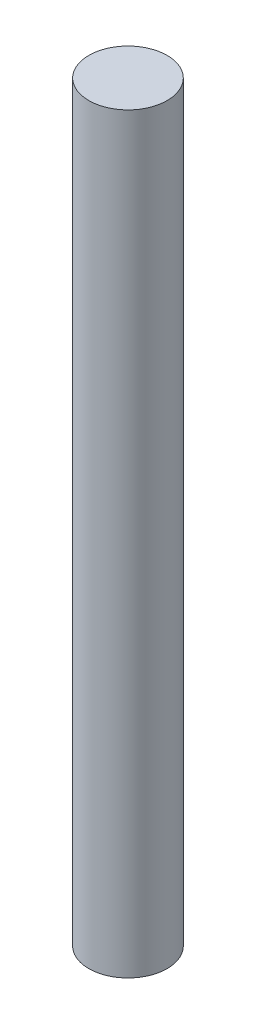
ISO-10303-21;
HEADER;
FILE_DESCRIPTION(('STEP AP214'),'2;1');
FILE_NAME('part.step','',(''),(''),'','','');
FILE_SCHEMA(('AUTOMOTIVE_DESIGN { 1 0 10303 214 1 1 1 1 }'));
ENDSEC;
DATA;
#1=APPLICATION_CONTEXT('core data for automotive mechanical design processes');
#2=APPLICATION_PROTOCOL_DEFINITION('international standard','automotive_design',2000,#1);
#3=PRODUCT_CONTEXT('',#1,'mechanical');
#4=PRODUCT('Part','Part','',(#3));
#5=PRODUCT_RELATED_PRODUCT_CATEGORY('part','',(#4));
#6=PRODUCT_DEFINITION_FORMATION('','',#4);
#7=PRODUCT_DEFINITION_CONTEXT('part definition',#1,'design');
#8=PRODUCT_DEFINITION('design','',#6,#7);
#9=PRODUCT_DEFINITION_SHAPE('','',#8);
#10=(LENGTH_UNIT() NAMED_UNIT(*) SI_UNIT(.MILLI.,.METRE.));
#11=(NAMED_UNIT(*) PLANE_ANGLE_UNIT() SI_UNIT($,.RADIAN.));
#12=(NAMED_UNIT(*) SI_UNIT($,.STERADIAN.) SOLID_ANGLE_UNIT());
#13=UNCERTAINTY_MEASURE_WITH_UNIT(LENGTH_MEASURE(1.E-05),#10,'distance_accuracy_value','');
#14=(GEOMETRIC_REPRESENTATION_CONTEXT(3) GLOBAL_UNCERTAINTY_ASSIGNED_CONTEXT((#13)) GLOBAL_UNIT_ASSIGNED_CONTEXT((#10,
#11,#12)) REPRESENTATION_CONTEXT('',''));
#15=CARTESIAN_POINT('',(0.,0.,0.));
#16=DIRECTION('',(0.,0.,1.));
#17=DIRECTION('',(1.,0.,0.));
#18=AXIS2_PLACEMENT_3D('',#15,#16,#17);
#19=CARTESIAN_POINT('',(0.,76.2,0.));
#20=DIRECTION('',(0.,-1.,0.));
#21=DIRECTION('',(0.,0.,-1.));
#22=AXIS2_PLACEMENT_3D('',#19,#20,#21);
#23=CYLINDRICAL_SURFACE('',#22,3.96875);
#24=CARTESIAN_POINT('',(0.,76.2,0.));
#25=DIRECTION('',(0.,1.,0.));
#26=DIRECTION('',(0.,0.,1.));
#27=AXIS2_PLACEMENT_3D('',#24,#25,#26);
#28=CIRCLE('',#27,3.96875);
#29=CARTESIAN_POINT('',(0.,76.2,3.96875));
#30=VERTEX_POINT('',#29);
#31=EDGE_CURVE('E10',#30,#30,#28,.T.);
#32=ORIENTED_EDGE('',*,*,#31,.F.);
#33=EDGE_LOOP('',(#32));
#34=FACE_BOUND('',#33,.T.);
#35=CARTESIAN_POINT('',(0.,0.,0.));
#36=DIRECTION('',(0.,1.,0.));
#37=DIRECTION('',(0.,0.,1.));
#38=AXIS2_PLACEMENT_3D('',#35,#36,#37);
#39=CIRCLE('',#38,3.96875);
#40=CARTESIAN_POINT('',(0.,0.,3.96875));
#41=VERTEX_POINT('',#40);
#42=EDGE_CURVE('E34',#41,#41,#39,.T.);
#43=ORIENTED_EDGE('',*,*,#42,.T.);
#44=EDGE_LOOP('',(#43));
#45=FACE_BOUND('',#44,.T.);
#46=ADVANCED_FACE('F31',(#34,#45),#23,.T.);
#47=CARTESIAN_POINT('',(0.,76.2,0.));
#48=DIRECTION('',(0.,1.,0.));
#49=DIRECTION('',(0.,0.,1.));
#50=AXIS2_PLACEMENT_3D('',#47,#48,#49);
#51=PLANE('',#50);
#52=ORIENTED_EDGE('',*,*,#31,.T.);
#53=EDGE_LOOP('',(#52));
#54=FACE_BOUND('',#53,.T.);
#55=ADVANCED_FACE('F46',(#54),#51,.T.);
#56=CARTESIAN_POINT('',(0.,0.,0.));
#57=DIRECTION('',(0.,1.,0.));
#58=DIRECTION('',(0.,0.,1.));
#59=AXIS2_PLACEMENT_3D('',#56,#57,#58);
#60=PLANE('',#59);
#61=ORIENTED_EDGE('',*,*,#42,.F.);
#62=EDGE_LOOP('',(#61));
#63=FACE_BOUND('',#62,.T.);
#64=ADVANCED_FACE('F44',(#63),#60,.F.);
#65=CLOSED_SHELL('',(#46,#55,#64));
#66=MANIFOLD_SOLID_BREP('B2',#65);
#67=ADVANCED_BREP_SHAPE_REPRESENTATION('',(#18,#66),#14);
#68=SHAPE_DEFINITION_REPRESENTATION(#9,#67);
ENDSEC;
END-ISO-10303-21;
